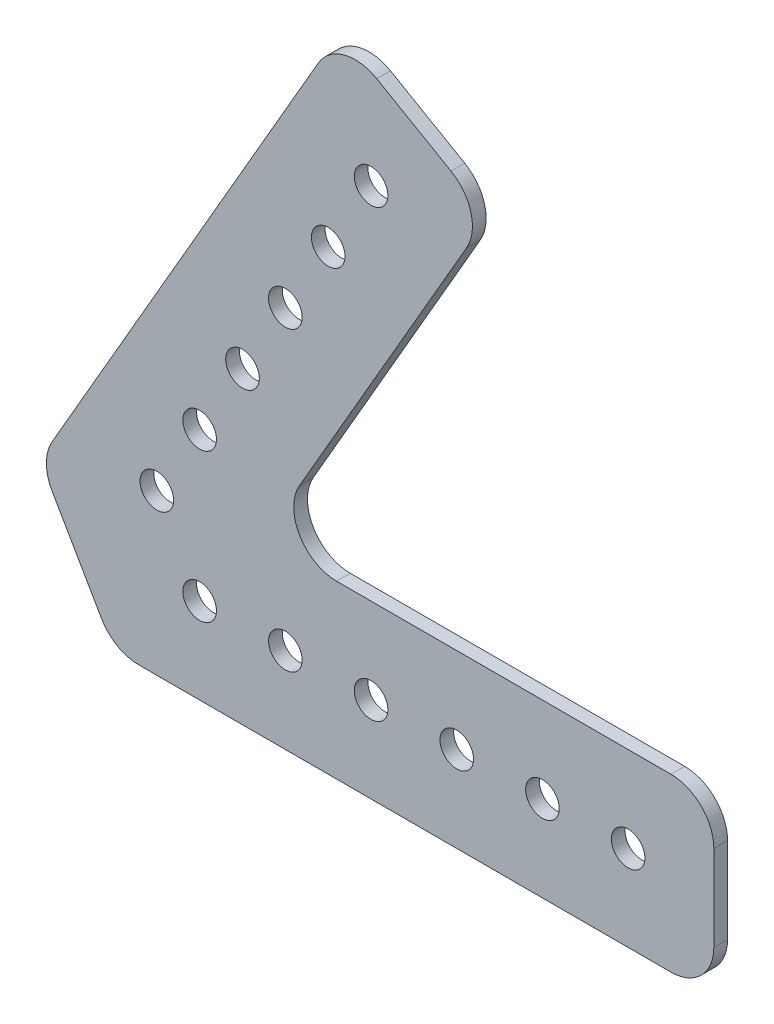
ISO-10303-21;
HEADER;
FILE_DESCRIPTION(('STEP AP214'),'2;1');
FILE_NAME('part.step','',(''),(''),'','','');
FILE_SCHEMA(('AUTOMOTIVE_DESIGN { 1 0 10303 214 1 1 1 1 }'));
ENDSEC;
DATA;
#1=APPLICATION_CONTEXT('core data for automotive mechanical design processes');
#2=APPLICATION_PROTOCOL_DEFINITION('international standard','automotive_design',2000,#1);
#3=PRODUCT_CONTEXT('',#1,'mechanical');
#4=PRODUCT('Part','Part','',(#3));
#5=PRODUCT_RELATED_PRODUCT_CATEGORY('part','',(#4));
#6=PRODUCT_DEFINITION_FORMATION('','',#4);
#7=PRODUCT_DEFINITION_CONTEXT('part definition',#1,'design');
#8=PRODUCT_DEFINITION('design','',#6,#7);
#9=PRODUCT_DEFINITION_SHAPE('','',#8);
#10=(LENGTH_UNIT() NAMED_UNIT(*) SI_UNIT(.MILLI.,.METRE.));
#11=(NAMED_UNIT(*) PLANE_ANGLE_UNIT() SI_UNIT($,.RADIAN.));
#12=(NAMED_UNIT(*) SI_UNIT($,.STERADIAN.) SOLID_ANGLE_UNIT());
#13=UNCERTAINTY_MEASURE_WITH_UNIT(LENGTH_MEASURE(1.E-05),#10,'distance_accuracy_value','');
#14=(GEOMETRIC_REPRESENTATION_CONTEXT(3) GLOBAL_UNCERTAINTY_ASSIGNED_CONTEXT((#13)) GLOBAL_UNIT_ASSIGNED_CONTEXT((#10,
#11,#12)) REPRESENTATION_CONTEXT('',''));
#15=CARTESIAN_POINT('',(0.,0.,0.));
#16=DIRECTION('',(0.,0.,1.));
#17=DIRECTION('',(1.,0.,0.));
#18=AXIS2_PLACEMENT_3D('',#15,#16,#17);
#19=CARTESIAN_POINT('',(-51.137282984279,34.5023148343583,0.));
#20=DIRECTION('',(0.,0.,1.));
#21=DIRECTION('',(1.,0.,0.));
#22=AXIS2_PLACEMENT_3D('',#19,#20,#21);
#23=PLANE('',#22);
#24=CARTESIAN_POINT('',(-12.7,12.7,0.));
#25=DIRECTION('',(0.,0.,1.));
#26=DIRECTION('',(1.,0.,0.));
#27=AXIS2_PLACEMENT_3D('',#24,#25,#26);
#28=CIRCLE('',#27,2.4892);
#29=CARTESIAN_POINT('',(-10.2108,12.7,0.));
#30=VERTEX_POINT('',#29);
#31=EDGE_CURVE('E222',#30,#30,#28,.T.);
#32=ORIENTED_EDGE('',*,*,#31,.T.);
#33=EDGE_LOOP('',(#32));
#34=FACE_BOUND('',#33,.T.);
#35=CARTESIAN_POINT('',(-57.15,67.6926131403119,0.));
#36=DIRECTION('',(0.,0.,1.));
#37=DIRECTION('',(1.,0.,0.));
#38=AXIS2_PLACEMENT_3D('',#35,#36,#37);
#39=CIRCLE('',#38,2.4892);
#40=CARTESIAN_POINT('',(-54.6608,67.6926131403119,0.));
#41=VERTEX_POINT('',#40);
#42=EDGE_CURVE('E225',#41,#41,#39,.T.);
#43=ORIENTED_EDGE('',*,*,#42,.T.);
#44=EDGE_LOOP('',(#43));
#45=FACE_BOUND('',#44,.T.);
#46=CARTESIAN_POINT('',(-69.85,45.6955678841872,0.));
#47=DIRECTION('',(0.,0.,1.));
#48=DIRECTION('',(1.,0.,0.));
#49=AXIS2_PLACEMENT_3D('',#46,#47,#48);
#50=CIRCLE('',#49,2.4892);
#51=CARTESIAN_POINT('',(-67.3608,45.6955678841872,0.));
#52=VERTEX_POINT('',#51);
#53=EDGE_CURVE('E228',#52,#52,#50,.T.);
#54=ORIENTED_EDGE('',*,*,#53,.T.);
#55=EDGE_LOOP('',(#54));
#56=FACE_BOUND('',#55,.T.);
#57=CARTESIAN_POINT('',(-25.4,12.7,0.));
#58=DIRECTION('',(0.,0.,1.));
#59=DIRECTION('',(1.,0.,0.));
#60=AXIS2_PLACEMENT_3D('',#57,#58,#59);
#61=CIRCLE('',#60,2.4892);
#62=CARTESIAN_POINT('',(-22.9108,12.7,0.));
#63=VERTEX_POINT('',#62);
#64=EDGE_CURVE('E231',#63,#63,#61,.T.);
#65=ORIENTED_EDGE('',*,*,#64,.T.);
#66=EDGE_LOOP('',(#65));
#67=FACE_BOUND('',#66,.T.);
#68=CARTESIAN_POINT('',(-50.8,12.7,0.));
#69=DIRECTION('',(0.,0.,1.));
#70=DIRECTION('',(1.,0.,0.));
#71=AXIS2_PLACEMENT_3D('',#68,#69,#70);
#72=CIRCLE('',#71,2.4892);
#73=CARTESIAN_POINT('',(-48.3108,12.7,0.));
#74=VERTEX_POINT('',#73);
#75=EDGE_CURVE('E234',#74,#74,#72,.T.);
#76=ORIENTED_EDGE('',*,*,#75,.T.);
#77=EDGE_LOOP('',(#76));
#78=FACE_BOUND('',#77,.T.);
#79=CARTESIAN_POINT('',(-82.55,23.6985226280624,0.));
#80=DIRECTION('',(0.,0.,1.));
#81=DIRECTION('',(1.,0.,0.));
#82=AXIS2_PLACEMENT_3D('',#79,#80,#81);
#83=CIRCLE('',#82,2.4892);
#84=CARTESIAN_POINT('',(-80.0608,23.6985226280624,0.));
#85=VERTEX_POINT('',#84);
#86=EDGE_CURVE('E237',#85,#85,#83,.T.);
#87=ORIENTED_EDGE('',*,*,#86,.T.);
#88=EDGE_LOOP('',(#87));
#89=FACE_BOUND('',#88,.T.);
#90=CARTESIAN_POINT('',(-76.2,12.7,0.));
#91=DIRECTION('',(0.,0.,1.));
#92=DIRECTION('',(1.,0.,0.));
#93=AXIS2_PLACEMENT_3D('',#90,#91,#92);
#94=CIRCLE('',#93,2.4892);
#95=CARTESIAN_POINT('',(-73.7108,12.7,0.));
#96=VERTEX_POINT('',#95);
#97=EDGE_CURVE('E240',#96,#96,#94,.T.);
#98=ORIENTED_EDGE('',*,*,#97,.T.);
#99=EDGE_LOOP('',(#98));
#100=FACE_BOUND('',#99,.T.);
#101=CARTESIAN_POINT('',(-63.5,12.7,0.));
#102=DIRECTION('',(0.,0.,1.));
#103=DIRECTION('',(1.,0.,0.));
#104=AXIS2_PLACEMENT_3D('',#101,#102,#103);
#105=CIRCLE('',#104,2.4892);
#106=CARTESIAN_POINT('',(-61.0108,12.7,0.));
#107=VERTEX_POINT('',#106);
#108=EDGE_CURVE('E243',#107,#107,#105,.T.);
#109=ORIENTED_EDGE('',*,*,#108,.T.);
#110=EDGE_LOOP('',(#109));
#111=FACE_BOUND('',#110,.T.);
#112=CARTESIAN_POINT('',(-38.1,12.7,0.));
#113=DIRECTION('',(0.,0.,1.));
#114=DIRECTION('',(1.,0.,0.));
#115=AXIS2_PLACEMENT_3D('',#112,#113,#114);
#116=CIRCLE('',#115,2.4892);
#117=CARTESIAN_POINT('',(-35.6108,12.7,0.));
#118=VERTEX_POINT('',#117);
#119=EDGE_CURVE('E246',#118,#118,#116,.T.);
#120=ORIENTED_EDGE('',*,*,#119,.T.);
#121=EDGE_LOOP('',(#120));
#122=FACE_BOUND('',#121,.T.);
#123=CARTESIAN_POINT('',(-76.2,34.6970452561248,0.));
#124=DIRECTION('',(0.,0.,1.));
#125=DIRECTION('',(1.,0.,0.));
#126=AXIS2_PLACEMENT_3D('',#123,#124,#125);
#127=CIRCLE('',#126,2.4892);
#128=CARTESIAN_POINT('',(-73.7108,34.6970452561248,0.));
#129=VERTEX_POINT('',#128);
#130=EDGE_CURVE('E249',#129,#129,#127,.T.);
#131=ORIENTED_EDGE('',*,*,#130,.T.);
#132=EDGE_LOOP('',(#131));
#133=FACE_BOUND('',#132,.T.);
#134=CARTESIAN_POINT('',(-63.5,56.6940905122495,0.));
#135=DIRECTION('',(0.,0.,1.));
#136=DIRECTION('',(1.,0.,0.));
#137=AXIS2_PLACEMENT_3D('',#134,#135,#136);
#138=CIRCLE('',#137,2.4892);
#139=CARTESIAN_POINT('',(-61.0108,56.6940905122495,0.));
#140=VERTEX_POINT('',#139);
#141=EDGE_CURVE('E136',#140,#140,#138,.T.);
#142=ORIENTED_EDGE('',*,*,#141,.T.);
#143=EDGE_LOOP('',(#142));
#144=FACE_BOUND('',#143,.T.);
#145=CARTESIAN_POINT('',(-50.8,78.6911357683743,0.));
#146=DIRECTION('',(0.,0.,1.));
#147=DIRECTION('',(1.,0.,0.));
#148=AXIS2_PLACEMENT_3D('',#145,#146,#147);
#149=CIRCLE('',#148,2.4892);
#150=CARTESIAN_POINT('',(-48.3108,78.6911357683743,0.));
#151=VERTEX_POINT('',#150);
#152=EDGE_CURVE('E133',#151,#151,#149,.T.);
#153=ORIENTED_EDGE('',*,*,#152,.T.);
#154=EDGE_LOOP('',(#153));
#155=FACE_BOUND('',#154,.T.);
#156=DIRECTION('',(-0.5,-0.866025403784439,0.));
#157=VECTOR('',#156,1.);
#158=CARTESIAN_POINT('',(-55.4485226280624,96.0396583964365,0.));
#159=LINE('',#158,#157);
#160=CARTESIAN_POINT('',(-58.6235226280623,90.5403970824054,0.));
#161=VERTEX_POINT('',#160);
#162=CARTESIAN_POINT('',(-98.0654355233853,22.2249999999999,0.));
#163=VERTEX_POINT('',#162);
#164=EDGE_CURVE('E117',#161,#163,#159,.T.);
#165=ORIENTED_EDGE('',*,*,#164,.F.);
#166=CARTESIAN_POINT('',(-53.1242613140312,87.3653970824055,0.));
#167=DIRECTION('',(0.,0.,1.));
#168=DIRECTION('',(1.,0.,0.));
#169=AXIS2_PLACEMENT_3D('',#166,#167,#168);
#170=CIRCLE('',#169,6.35);
#171=CARTESIAN_POINT('',(-49.9492613140311,92.8646583964367,0.));
#172=VERTEX_POINT('',#171);
#173=EDGE_CURVE('E130',#172,#161,#170,.T.);
#174=ORIENTED_EDGE('',*,*,#173,.F.);
#175=DIRECTION('',(-0.866025403784439,0.5,0.));
#176=VECTOR('',#175,1.);
#177=CARTESIAN_POINT('',(-33.4514773719376,83.3396583964367,0.));
#178=LINE('',#177,#176);
#179=CARTESIAN_POINT('',(-38.9507386859688,86.5146583964367,0.));
#180=VERTEX_POINT('',#179);
#181=EDGE_CURVE('E142',#180,#172,#178,.T.);
#182=ORIENTED_EDGE('',*,*,#181,.F.);
#183=CARTESIAN_POINT('',(-42.1257386859688,81.0153970824055,0.));
#184=DIRECTION('',(0.,0.,1.));
#185=DIRECTION('',(1.,0.,0.));
#186=AXIS2_PLACEMENT_3D('',#183,#184,#185);
#187=CIRCLE('',#186,6.35);
#188=CARTESIAN_POINT('',(-36.6264773719376,77.8403970824055,0.));
#189=VERTEX_POINT('',#188);
#190=EDGE_CURVE('E255',#189,#180,#187,.T.);
#191=ORIENTED_EDGE('',*,*,#190,.F.);
#192=DIRECTION('',(0.5,0.866025403784439,0.));
#193=VECTOR('',#192,1.);
#194=CARTESIAN_POINT('',(-66.9029547438752,25.4,0.));
#195=LINE('',#194,#193);
#196=CARTESIAN_POINT('',(-61.403693429844,34.925,0.));
#197=VERTEX_POINT('',#196);
#198=EDGE_CURVE('E146',#197,#189,#195,.T.);
#199=ORIENTED_EDGE('',*,*,#198,.F.);
#200=CARTESIAN_POINT('',(-55.9044321158128,31.75,0.));
#201=DIRECTION('',(0.,0.,1.));
#202=DIRECTION('',(1.,0.,0.));
#203=AXIS2_PLACEMENT_3D('',#200,#201,#202);
#204=CIRCLE('',#203,6.35);
#205=CARTESIAN_POINT('',(-55.9044321158128,25.4,0.));
#206=VERTEX_POINT('',#205);
#207=EDGE_CURVE('E257',#197,#206,#204,.T.);
#208=ORIENTED_EDGE('',*,*,#207,.T.);
#209=DIRECTION('',(1.,0.,0.));
#210=VECTOR('',#209,1.);
#211=CARTESIAN_POINT('',(0.,25.4,0.));
#212=LINE('',#211,#210);
#213=CARTESIAN_POINT('',(-6.35,25.4,0.));
#214=VERTEX_POINT('',#213);
#215=EDGE_CURVE('E150',#214,#206,#212,.F.);
#216=ORIENTED_EDGE('',*,*,#215,.F.);
#217=CARTESIAN_POINT('',(-6.35,19.05,0.));
#218=DIRECTION('',(0.,0.,1.));
#219=DIRECTION('',(1.,0.,0.));
#220=AXIS2_PLACEMENT_3D('',#217,#218,#219);
#221=CIRCLE('',#220,6.35);
#222=CARTESIAN_POINT('',(0.,19.05,0.));
#223=VERTEX_POINT('',#222);
#224=EDGE_CURVE('E260',#223,#214,#221,.T.);
#225=ORIENTED_EDGE('',*,*,#224,.F.);
#226=DIRECTION('',(0.,1.,0.));
#227=VECTOR('',#226,1.);
#228=CARTESIAN_POINT('',(0.,0.,0.));
#229=LINE('',#228,#227);
#230=CARTESIAN_POINT('',(0.,6.35,0.));
#231=VERTEX_POINT('',#230);
#232=EDGE_CURVE('E154',#231,#223,#229,.T.);
#233=ORIENTED_EDGE('',*,*,#232,.F.);
#234=CARTESIAN_POINT('',(-6.35,6.35,0.));
#235=DIRECTION('',(0.,0.,1.));
#236=DIRECTION('',(1.,0.,0.));
#237=AXIS2_PLACEMENT_3D('',#234,#235,#236);
#238=CIRCLE('',#237,6.35);
#239=CARTESIAN_POINT('',(-6.35,0.,0.));
#240=VERTEX_POINT('',#239);
#241=EDGE_CURVE('E262',#240,#231,#238,.T.);
#242=ORIENTED_EDGE('',*,*,#241,.F.);
#243=DIRECTION('',(1.,0.,0.));
#244=VECTOR('',#243,1.);
#245=CARTESIAN_POINT('',(-88.9,0.,0.));
#246=LINE('',#245,#244);
#247=CARTESIAN_POINT('',(-85.2338257906458,0.,0.));
#248=VERTEX_POINT('',#247);
#249=EDGE_CURVE('E158',#248,#240,#246,.T.);
#250=ORIENTED_EDGE('',*,*,#249,.F.);
#251=CARTESIAN_POINT('',(-85.2338257906458,6.35,0.));
#252=DIRECTION('',(0.,0.,1.));
#253=DIRECTION('',(1.,0.,0.));
#254=AXIS2_PLACEMENT_3D('',#251,#252,#253);
#255=CIRCLE('',#254,6.35);
#256=CARTESIAN_POINT('',(-90.733087104677,3.17499999999999,0.));
#257=VERTEX_POINT('',#256);
#258=EDGE_CURVE('E263',#257,#248,#255,.T.);
#259=ORIENTED_EDGE('',*,*,#258,.F.);
#260=DIRECTION('',(0.499999999999999,-0.866025403784439,0.));
#261=VECTOR('',#260,1.);
#262=CARTESIAN_POINT('',(-99.8985226280624,19.05,0.));
#263=LINE('',#262,#261);
#264=CARTESIAN_POINT('',(-98.0654355233853,15.875,0.));
#265=VERTEX_POINT('',#264);
#266=EDGE_CURVE('E119',#265,#257,#263,.T.);
#267=ORIENTED_EDGE('',*,*,#266,.F.);
#268=CARTESIAN_POINT('',(-92.5661742093542,19.05,0.));
#269=DIRECTION('',(0.,0.,1.));
#270=DIRECTION('',(1.,0.,0.));
#271=AXIS2_PLACEMENT_3D('',#268,#269,#270);
#272=CIRCLE('',#271,6.35);
#273=EDGE_CURVE('E18',#163,#265,#272,.T.);
#274=ORIENTED_EDGE('',*,*,#273,.F.);
#275=EDGE_LOOP('',(#165,#174,#182,#191,#199,#208,#216,#225,#233,#242,#250,#259,#267,#274));
#276=FACE_BOUND('',#275,.T.);
#277=ADVANCED_FACE('F15',(#34,#45,#56,#67,#78,#89,#100,#111,#122,#133,#144,#155,#276),#23,.F.);
#278=CARTESIAN_POINT('',(-92.5661742093542,19.05,0.));
#279=DIRECTION('',(0.,0.,1.));
#280=DIRECTION('',(1.,0.,0.));
#281=AXIS2_PLACEMENT_3D('',#278,#279,#280);
#282=CYLINDRICAL_SURFACE('',#281,6.35);
#283=ORIENTED_EDGE('',*,*,#273,.T.);
#284=DIRECTION('',(0.,0.,1.));
#285=VECTOR('',#284,1.);
#286=CARTESIAN_POINT('',(-98.0654355233853,15.875,0.));
#287=LINE('',#286,#285);
#288=CARTESIAN_POINT('',(-98.0654355233853,15.875,2.032));
#289=VERTEX_POINT('',#288);
#290=EDGE_CURVE('E122',#289,#265,#287,.F.);
#291=ORIENTED_EDGE('',*,*,#290,.F.);
#292=CARTESIAN_POINT('',(-92.5661742093542,19.05,2.032));
#293=DIRECTION('',(0.,0.,1.));
#294=DIRECTION('',(1.,0.,0.));
#295=AXIS2_PLACEMENT_3D('',#292,#293,#294);
#296=CIRCLE('',#295,6.35);
#297=CARTESIAN_POINT('',(-98.0654355233853,22.225,2.032));
#298=VERTEX_POINT('',#297);
#299=EDGE_CURVE('E127',#298,#289,#296,.T.);
#300=ORIENTED_EDGE('',*,*,#299,.F.);
#301=DIRECTION('',(0.,0.,1.));
#302=VECTOR('',#301,1.);
#303=CARTESIAN_POINT('',(-98.0654355233853,22.2249999999999,0.));
#304=LINE('',#303,#302);
#305=EDGE_CURVE('E124',#163,#298,#304,.T.);
#306=ORIENTED_EDGE('',*,*,#305,.F.);
#307=EDGE_LOOP('',(#283,#291,#300,#306));
#308=FACE_BOUND('',#307,.T.);
#309=ADVANCED_FACE('F125',(#308),#282,.T.);
#310=CARTESIAN_POINT('',(-99.8985226280624,19.05,0.));
#311=DIRECTION('',(-0.866025403784439,-0.499999999999999,0.));
#312=DIRECTION('',(0.499999999999999,-0.866025403784439,0.));
#313=AXIS2_PLACEMENT_3D('',#310,#311,#312);
#314=PLANE('',#313);
#315=DIRECTION('',(0.,0.,1.));
#316=VECTOR('',#315,1.);
#317=CARTESIAN_POINT('',(-90.733087104677,3.17500000000002,0.));
#318=LINE('',#317,#316);
#319=CARTESIAN_POINT('',(-90.733087104677,3.17499999999998,2.032));
#320=VERTEX_POINT('',#319);
#321=EDGE_CURVE('E162',#320,#257,#318,.F.);
#322=ORIENTED_EDGE('',*,*,#321,.F.);
#323=DIRECTION('',(0.500000000000009,-0.866025403784433,0.));
#324=VECTOR('',#323,1.);
#325=CARTESIAN_POINT('',(-98.0654355233854,15.875,2.032));
#326=LINE('',#325,#324);
#327=EDGE_CURVE('E220',#289,#320,#326,.T.);
#328=ORIENTED_EDGE('',*,*,#327,.F.);
#329=ORIENTED_EDGE('',*,*,#290,.T.);
#330=ORIENTED_EDGE('',*,*,#266,.T.);
#331=EDGE_LOOP('',(#322,#328,#329,#330));
#332=FACE_BOUND('',#331,.T.);
#333=ADVANCED_FACE('F341',(#332),#314,.T.);
#334=CARTESIAN_POINT('',(-85.2338257906458,6.35,0.));
#335=DIRECTION('',(0.,0.,1.));
#336=DIRECTION('',(1.,0.,0.));
#337=AXIS2_PLACEMENT_3D('',#334,#335,#336);
#338=CYLINDRICAL_SURFACE('',#337,6.35);
#339=ORIENTED_EDGE('',*,*,#258,.T.);
#340=DIRECTION('',(0.,0.,-1.));
#341=VECTOR('',#340,1.);
#342=CARTESIAN_POINT('',(-85.2338257906458,0.,0.));
#343=LINE('',#342,#341);
#344=CARTESIAN_POINT('',(-85.2338257906458,0.,2.032));
#345=VERTEX_POINT('',#344);
#346=EDGE_CURVE('E161',#345,#248,#343,.T.);
#347=ORIENTED_EDGE('',*,*,#346,.F.);
#348=CARTESIAN_POINT('',(-85.2338257906458,6.35,2.032));
#349=DIRECTION('',(0.,0.,1.));
#350=DIRECTION('',(1.,0.,0.));
#351=AXIS2_PLACEMENT_3D('',#348,#349,#350);
#352=CIRCLE('',#351,6.35);
#353=EDGE_CURVE('E217',#320,#345,#352,.T.);
#354=ORIENTED_EDGE('',*,*,#353,.F.);
#355=ORIENTED_EDGE('',*,*,#321,.T.);
#356=EDGE_LOOP('',(#339,#347,#354,#355));
#357=FACE_BOUND('',#356,.T.);
#358=ADVANCED_FACE('F338',(#357),#338,.T.);
#359=CARTESIAN_POINT('',(-88.9,0.,0.));
#360=DIRECTION('',(0.,-1.,0.));
#361=DIRECTION('',(0.,0.,-1.));
#362=AXIS2_PLACEMENT_3D('',#359,#360,#361);
#363=PLANE('',#362);
#364=DIRECTION('',(0.,0.,1.));
#365=VECTOR('',#364,1.);
#366=CARTESIAN_POINT('',(-6.35,0.,0.));
#367=LINE('',#366,#365);
#368=CARTESIAN_POINT('',(-6.35,0.,2.032));
#369=VERTEX_POINT('',#368);
#370=EDGE_CURVE('E160',#369,#240,#367,.F.);
#371=ORIENTED_EDGE('',*,*,#370,.F.);
#372=DIRECTION('',(1.,0.,0.));
#373=VECTOR('',#372,1.);
#374=CARTESIAN_POINT('',(-51.137282984279,0.,2.032));
#375=LINE('',#374,#373);
#376=EDGE_CURVE('E216',#345,#369,#375,.T.);
#377=ORIENTED_EDGE('',*,*,#376,.F.);
#378=ORIENTED_EDGE('',*,*,#346,.T.);
#379=ORIENTED_EDGE('',*,*,#249,.T.);
#380=EDGE_LOOP('',(#371,#377,#378,#379));
#381=FACE_BOUND('',#380,.T.);
#382=ADVANCED_FACE('F337',(#381),#363,.T.);
#383=CARTESIAN_POINT('',(-6.35,6.35,0.));
#384=DIRECTION('',(0.,0.,1.));
#385=DIRECTION('',(1.,0.,0.));
#386=AXIS2_PLACEMENT_3D('',#383,#384,#385);
#387=CYLINDRICAL_SURFACE('',#386,6.35);
#388=ORIENTED_EDGE('',*,*,#241,.T.);
#389=DIRECTION('',(0.,0.,1.));
#390=VECTOR('',#389,1.);
#391=CARTESIAN_POINT('',(0.,6.35,0.));
#392=LINE('',#391,#390);
#393=CARTESIAN_POINT('',(0.,6.35,2.032));
#394=VERTEX_POINT('',#393);
#395=EDGE_CURVE('E157',#394,#231,#392,.F.);
#396=ORIENTED_EDGE('',*,*,#395,.F.);
#397=CARTESIAN_POINT('',(-6.35,6.35,2.032));
#398=DIRECTION('',(0.,0.,1.));
#399=DIRECTION('',(1.,0.,0.));
#400=AXIS2_PLACEMENT_3D('',#397,#398,#399);
#401=CIRCLE('',#400,6.35);
#402=EDGE_CURVE('E213',#369,#394,#401,.T.);
#403=ORIENTED_EDGE('',*,*,#402,.F.);
#404=ORIENTED_EDGE('',*,*,#370,.T.);
#405=EDGE_LOOP('',(#388,#396,#403,#404));
#406=FACE_BOUND('',#405,.T.);
#407=ADVANCED_FACE('F334',(#406),#387,.T.);
#408=CARTESIAN_POINT('',(0.,0.,0.));
#409=DIRECTION('',(1.,0.,0.));
#410=DIRECTION('',(0.,1.,0.));
#411=AXIS2_PLACEMENT_3D('',#408,#409,#410);
#412=PLANE('',#411);
#413=DIRECTION('',(0.,0.,1.));
#414=VECTOR('',#413,1.);
#415=CARTESIAN_POINT('',(0.,19.05,0.));
#416=LINE('',#415,#414);
#417=CARTESIAN_POINT('',(0.,19.05,2.032));
#418=VERTEX_POINT('',#417);
#419=EDGE_CURVE('E156',#418,#223,#416,.F.);
#420=ORIENTED_EDGE('',*,*,#419,.F.);
#421=DIRECTION('',(0.,1.,0.));
#422=VECTOR('',#421,1.);
#423=CARTESIAN_POINT('',(0.,34.5023148343583,2.032));
#424=LINE('',#423,#422);
#425=EDGE_CURVE('E212',#394,#418,#424,.T.);
#426=ORIENTED_EDGE('',*,*,#425,.F.);
#427=ORIENTED_EDGE('',*,*,#395,.T.);
#428=ORIENTED_EDGE('',*,*,#232,.T.);
#429=EDGE_LOOP('',(#420,#426,#427,#428));
#430=FACE_BOUND('',#429,.T.);
#431=ADVANCED_FACE('F330',(#430),#412,.T.);
#432=CARTESIAN_POINT('',(-6.35,19.05,0.));
#433=DIRECTION('',(0.,0.,1.));
#434=DIRECTION('',(1.,0.,0.));
#435=AXIS2_PLACEMENT_3D('',#432,#433,#434);
#436=CYLINDRICAL_SURFACE('',#435,6.35);
#437=ORIENTED_EDGE('',*,*,#224,.T.);
#438=DIRECTION('',(0.,0.,1.));
#439=VECTOR('',#438,1.);
#440=CARTESIAN_POINT('',(-6.35,25.4,0.));
#441=LINE('',#440,#439);
#442=CARTESIAN_POINT('',(-6.35,25.4,2.032));
#443=VERTEX_POINT('',#442);
#444=EDGE_CURVE('E153',#443,#214,#441,.F.);
#445=ORIENTED_EDGE('',*,*,#444,.F.);
#446=CARTESIAN_POINT('',(-6.35,19.05,2.032));
#447=DIRECTION('',(0.,0.,1.));
#448=DIRECTION('',(1.,0.,0.));
#449=AXIS2_PLACEMENT_3D('',#446,#447,#448);
#450=CIRCLE('',#449,6.35);
#451=EDGE_CURVE('E209',#418,#443,#450,.T.);
#452=ORIENTED_EDGE('',*,*,#451,.F.);
#453=ORIENTED_EDGE('',*,*,#419,.T.);
#454=EDGE_LOOP('',(#437,#445,#452,#453));
#455=FACE_BOUND('',#454,.T.);
#456=ADVANCED_FACE('F327',(#455),#436,.T.);
#457=CARTESIAN_POINT('',(0.,25.4,0.));
#458=DIRECTION('',(0.,1.,0.));
#459=DIRECTION('',(0.,0.,1.));
#460=AXIS2_PLACEMENT_3D('',#457,#458,#459);
#461=PLANE('',#460);
#462=ORIENTED_EDGE('',*,*,#444,.T.);
#463=ORIENTED_EDGE('',*,*,#215,.T.);
#464=DIRECTION('',(0.,0.,1.));
#465=VECTOR('',#464,1.);
#466=CARTESIAN_POINT('',(-55.9044321158128,25.4,0.));
#467=LINE('',#466,#465);
#468=CARTESIAN_POINT('',(-55.9044321158128,25.4,2.032));
#469=VERTEX_POINT('',#468);
#470=EDGE_CURVE('E152',#206,#469,#467,.T.);
#471=ORIENTED_EDGE('',*,*,#470,.T.);
#472=DIRECTION('',(1.,0.,0.));
#473=VECTOR('',#472,1.);
#474=CARTESIAN_POINT('',(-51.137282984279,25.4,2.032));
#475=LINE('',#474,#473);
#476=EDGE_CURVE('E208',#443,#469,#475,.F.);
#477=ORIENTED_EDGE('',*,*,#476,.F.);
#478=EDGE_LOOP('',(#462,#463,#471,#477));
#479=FACE_BOUND('',#478,.T.);
#480=ADVANCED_FACE('F324',(#479),#461,.T.);
#481=CARTESIAN_POINT('',(-55.9044321158128,31.75,0.));
#482=DIRECTION('',(0.,0.,1.));
#483=DIRECTION('',(1.,0.,0.));
#484=AXIS2_PLACEMENT_3D('',#481,#482,#483);
#485=CYLINDRICAL_SURFACE('',#484,6.35);
#486=DIRECTION('',(0.,0.,1.));
#487=VECTOR('',#486,1.);
#488=CARTESIAN_POINT('',(-61.403693429844,34.925,0.));
#489=LINE('',#488,#487);
#490=CARTESIAN_POINT('',(-61.403693429844,34.925,2.032));
#491=VERTEX_POINT('',#490);
#492=EDGE_CURVE('E149',#491,#197,#489,.F.);
#493=ORIENTED_EDGE('',*,*,#492,.F.);
#494=CARTESIAN_POINT('',(-55.9044321158128,31.75,2.032));
#495=DIRECTION('',(0.,0.,1.));
#496=DIRECTION('',(1.,0.,0.));
#497=AXIS2_PLACEMENT_3D('',#494,#495,#496);
#498=CIRCLE('',#497,6.35);
#499=EDGE_CURVE('E205',#469,#491,#498,.F.);
#500=ORIENTED_EDGE('',*,*,#499,.F.);
#501=ORIENTED_EDGE('',*,*,#470,.F.);
#502=ORIENTED_EDGE('',*,*,#207,.F.);
#503=EDGE_LOOP('',(#493,#500,#501,#502));
#504=FACE_BOUND('',#503,.T.);
#505=ADVANCED_FACE('F317',(#504),#485,.F.);
#506=CARTESIAN_POINT('',(-66.9029547438752,25.4,0.));
#507=DIRECTION('',(0.866025403784439,-0.5,0.));
#508=DIRECTION('',(0.5,0.866025403784439,0.));
#509=AXIS2_PLACEMENT_3D('',#506,#507,#508);
#510=PLANE('',#509);
#511=DIRECTION('',(0.,0.,1.));
#512=VECTOR('',#511,1.);
#513=CARTESIAN_POINT('',(-36.6264773719376,77.8403970824055,0.));
#514=LINE('',#513,#512);
#515=CARTESIAN_POINT('',(-36.6264773719376,77.8403970824055,2.032));
#516=VERTEX_POINT('',#515);
#517=EDGE_CURVE('E148',#516,#189,#514,.F.);
#518=ORIENTED_EDGE('',*,*,#517,.F.);
#519=DIRECTION('',(0.499999999999999,0.866025403784439,0.));
#520=VECTOR('',#519,1.);
#521=CARTESIAN_POINT('',(-61.403693429844,34.925,2.032));
#522=LINE('',#521,#520);
#523=EDGE_CURVE('E204',#491,#516,#522,.T.);
#524=ORIENTED_EDGE('',*,*,#523,.F.);
#525=ORIENTED_EDGE('',*,*,#492,.T.);
#526=ORIENTED_EDGE('',*,*,#198,.T.);
#527=EDGE_LOOP('',(#518,#524,#525,#526));
#528=FACE_BOUND('',#527,.T.);
#529=ADVANCED_FACE('F314',(#528),#510,.T.);
#530=CARTESIAN_POINT('',(-42.1257386859688,81.0153970824055,0.));
#531=DIRECTION('',(0.,0.,1.));
#532=DIRECTION('',(1.,0.,0.));
#533=AXIS2_PLACEMENT_3D('',#530,#531,#532);
#534=CYLINDRICAL_SURFACE('',#533,6.35);
#535=ORIENTED_EDGE('',*,*,#190,.T.);
#536=DIRECTION('',(0.,0.,1.));
#537=VECTOR('',#536,1.);
#538=CARTESIAN_POINT('',(-38.9507386859688,86.5146583964367,0.));
#539=LINE('',#538,#537);
#540=CARTESIAN_POINT('',(-38.9507386859689,86.5146583964367,2.032));
#541=VERTEX_POINT('',#540);
#542=EDGE_CURVE('E145',#541,#180,#539,.F.);
#543=ORIENTED_EDGE('',*,*,#542,.F.);
#544=CARTESIAN_POINT('',(-42.1257386859688,81.0153970824055,2.032));
#545=DIRECTION('',(0.,0.,1.));
#546=DIRECTION('',(1.,0.,0.));
#547=AXIS2_PLACEMENT_3D('',#544,#545,#546);
#548=CIRCLE('',#547,6.35);
#549=EDGE_CURVE('E201',#516,#541,#548,.T.);
#550=ORIENTED_EDGE('',*,*,#549,.F.);
#551=ORIENTED_EDGE('',*,*,#517,.T.);
#552=EDGE_LOOP('',(#535,#543,#550,#551));
#553=FACE_BOUND('',#552,.T.);
#554=ADVANCED_FACE('F311',(#553),#534,.T.);
#555=CARTESIAN_POINT('',(-33.4514773719376,83.3396583964367,0.));
#556=DIRECTION('',(0.5,0.866025403784439,0.));
#557=DIRECTION('',(-0.866025403784439,0.5,0.));
#558=AXIS2_PLACEMENT_3D('',#555,#556,#557);
#559=PLANE('',#558);
#560=DIRECTION('',(0.,0.,1.));
#561=VECTOR('',#560,1.);
#562=CARTESIAN_POINT('',(-49.9492613140311,92.8646583964366,0.));
#563=LINE('',#562,#561);
#564=CARTESIAN_POINT('',(-49.9492613140312,92.8646583964366,2.032));
#565=VERTEX_POINT('',#564);
#566=EDGE_CURVE('E144',#565,#172,#563,.F.);
#567=ORIENTED_EDGE('',*,*,#566,.F.);
#568=DIRECTION('',(-0.866025403784448,0.499999999999984,0.));
#569=VECTOR('',#568,1.);
#570=CARTESIAN_POINT('',(-38.9507386859688,86.5146583964367,2.032));
#571=LINE('',#570,#569);
#572=EDGE_CURVE('E200',#541,#565,#571,.T.);
#573=ORIENTED_EDGE('',*,*,#572,.F.);
#574=ORIENTED_EDGE('',*,*,#542,.T.);
#575=ORIENTED_EDGE('',*,*,#181,.T.);
#576=EDGE_LOOP('',(#567,#573,#574,#575));
#577=FACE_BOUND('',#576,.T.);
#578=ADVANCED_FACE('F305',(#577),#559,.T.);
#579=CARTESIAN_POINT('',(-53.1242613140312,87.3653970824055,0.));
#580=DIRECTION('',(0.,0.,1.));
#581=DIRECTION('',(1.,0.,0.));
#582=AXIS2_PLACEMENT_3D('',#579,#580,#581);
#583=CYLINDRICAL_SURFACE('',#582,6.35);
#584=ORIENTED_EDGE('',*,*,#173,.T.);
#585=DIRECTION('',(0.,0.,1.));
#586=VECTOR('',#585,1.);
#587=CARTESIAN_POINT('',(-58.6235226280623,90.5403970824054,0.));
#588=LINE('',#587,#586);
#589=CARTESIAN_POINT('',(-58.6235226280623,90.5403970824055,2.032));
#590=VERTEX_POINT('',#589);
#591=EDGE_CURVE('E33',#590,#161,#588,.F.);
#592=ORIENTED_EDGE('',*,*,#591,.F.);
#593=CARTESIAN_POINT('',(-53.1242613140312,87.3653970824055,2.032));
#594=DIRECTION('',(0.,0.,1.));
#595=DIRECTION('',(1.,0.,0.));
#596=AXIS2_PLACEMENT_3D('',#593,#594,#595);
#597=CIRCLE('',#596,6.35);
#598=EDGE_CURVE('E197',#565,#590,#597,.T.);
#599=ORIENTED_EDGE('',*,*,#598,.F.);
#600=ORIENTED_EDGE('',*,*,#566,.T.);
#601=EDGE_LOOP('',(#584,#592,#599,#600));
#602=FACE_BOUND('',#601,.T.);
#603=ADVANCED_FACE('F303',(#602),#583,.T.);
#604=CARTESIAN_POINT('',(-55.4485226280624,96.0396583964365,0.));
#605=DIRECTION('',(-0.866025403784439,0.5,0.));
#606=DIRECTION('',(-0.5,-0.866025403784439,0.));
#607=AXIS2_PLACEMENT_3D('',#604,#605,#606);
#608=PLANE('',#607);
#609=ORIENTED_EDGE('',*,*,#591,.T.);
#610=ORIENTED_EDGE('',*,*,#164,.T.);
#611=ORIENTED_EDGE('',*,*,#305,.T.);
#612=DIRECTION('',(-0.5,-0.866025403784439,0.));
#613=VECTOR('',#612,1.);
#614=CARTESIAN_POINT('',(-58.6235226280624,90.5403970824055,2.032));
#615=LINE('',#614,#613);
#616=EDGE_CURVE('E196',#590,#298,#615,.T.);
#617=ORIENTED_EDGE('',*,*,#616,.F.);
#618=EDGE_LOOP('',(#609,#610,#611,#617));
#619=FACE_BOUND('',#618,.T.);
#620=ADVANCED_FACE('F132',(#619),#608,.T.);
#621=CARTESIAN_POINT('',(-50.8,78.6911357683743,138.590980342062));
#622=DIRECTION('',(0.,0.,1.));
#623=DIRECTION('',(1.,0.,0.));
#624=AXIS2_PLACEMENT_3D('',#621,#622,#623);
#625=CYLINDRICAL_SURFACE('',#624,2.4892);
#626=ORIENTED_EDGE('',*,*,#152,.F.);
#627=EDGE_LOOP('',(#626));
#628=FACE_BOUND('',#627,.T.);
#629=CARTESIAN_POINT('',(-50.8,78.6911357683743,2.03200000000001));
#630=DIRECTION('',(0.,0.,1.));
#631=DIRECTION('',(1.,0.,0.));
#632=AXIS2_PLACEMENT_3D('',#629,#630,#631);
#633=CIRCLE('',#632,2.4892);
#634=CARTESIAN_POINT('',(-48.3108,78.6911357683743,2.03200000000001));
#635=VERTEX_POINT('',#634);
#636=EDGE_CURVE('E193',#635,#635,#633,.F.);
#637=ORIENTED_EDGE('',*,*,#636,.F.);
#638=EDGE_LOOP('',(#637));
#639=FACE_BOUND('',#638,.T.);
#640=ADVANCED_FACE('F400',(#628,#639),#625,.F.);
#641=CARTESIAN_POINT('',(-63.5,56.6940905122495,138.590980342062));
#642=DIRECTION('',(0.,0.,1.));
#643=DIRECTION('',(1.,0.,0.));
#644=AXIS2_PLACEMENT_3D('',#641,#642,#643);
#645=CYLINDRICAL_SURFACE('',#644,2.4892);
#646=ORIENTED_EDGE('',*,*,#141,.F.);
#647=EDGE_LOOP('',(#646));
#648=FACE_BOUND('',#647,.T.);
#649=CARTESIAN_POINT('',(-63.5,56.6940905122495,2.03200000000001));
#650=DIRECTION('',(0.,0.,1.));
#651=DIRECTION('',(1.,0.,0.));
#652=AXIS2_PLACEMENT_3D('',#649,#650,#651);
#653=CIRCLE('',#652,2.4892);
#654=CARTESIAN_POINT('',(-61.0108,56.6940905122495,2.03200000000001));
#655=VERTEX_POINT('',#654);
#656=EDGE_CURVE('E190',#655,#655,#653,.F.);
#657=ORIENTED_EDGE('',*,*,#656,.F.);
#658=EDGE_LOOP('',(#657));
#659=FACE_BOUND('',#658,.T.);
#660=ADVANCED_FACE('F396',(#648,#659),#645,.F.);
#661=CARTESIAN_POINT('',(-76.2,34.6970452561248,138.590980342062));
#662=DIRECTION('',(0.,0.,1.));
#663=DIRECTION('',(1.,0.,0.));
#664=AXIS2_PLACEMENT_3D('',#661,#662,#663);
#665=CYLINDRICAL_SURFACE('',#664,2.4892);
#666=ORIENTED_EDGE('',*,*,#130,.F.);
#667=EDGE_LOOP('',(#666));
#668=FACE_BOUND('',#667,.T.);
#669=CARTESIAN_POINT('',(-76.2,34.6970452561248,2.03200000000001));
#670=DIRECTION('',(0.,0.,1.));
#671=DIRECTION('',(1.,0.,0.));
#672=AXIS2_PLACEMENT_3D('',#669,#670,#671);
#673=CIRCLE('',#672,2.4892);
#674=CARTESIAN_POINT('',(-73.7108,34.6970452561248,2.03200000000001));
#675=VERTEX_POINT('',#674);
#676=EDGE_CURVE('E187',#675,#675,#673,.F.);
#677=ORIENTED_EDGE('',*,*,#676,.F.);
#678=EDGE_LOOP('',(#677));
#679=FACE_BOUND('',#678,.T.);
#680=ADVANCED_FACE('F392',(#668,#679),#665,.F.);
#681=CARTESIAN_POINT('',(-38.1,12.7,138.590980342062));
#682=DIRECTION('',(0.,0.,1.));
#683=DIRECTION('',(1.,0.,0.));
#684=AXIS2_PLACEMENT_3D('',#681,#682,#683);
#685=CYLINDRICAL_SURFACE('',#684,2.4892);
#686=ORIENTED_EDGE('',*,*,#119,.F.);
#687=EDGE_LOOP('',(#686));
#688=FACE_BOUND('',#687,.T.);
#689=CARTESIAN_POINT('',(-38.1,12.7,2.03200000000001));
#690=DIRECTION('',(0.,0.,1.));
#691=DIRECTION('',(1.,0.,0.));
#692=AXIS2_PLACEMENT_3D('',#689,#690,#691);
#693=CIRCLE('',#692,2.4892);
#694=CARTESIAN_POINT('',(-35.6108,12.7,2.03200000000001));
#695=VERTEX_POINT('',#694);
#696=EDGE_CURVE('E184',#695,#695,#693,.F.);
#697=ORIENTED_EDGE('',*,*,#696,.F.);
#698=EDGE_LOOP('',(#697));
#699=FACE_BOUND('',#698,.T.);
#700=ADVANCED_FACE('F388',(#688,#699),#685,.F.);
#701=CARTESIAN_POINT('',(-63.5,12.7,138.590980342062));
#702=DIRECTION('',(0.,0.,1.));
#703=DIRECTION('',(1.,0.,0.));
#704=AXIS2_PLACEMENT_3D('',#701,#702,#703);
#705=CYLINDRICAL_SURFACE('',#704,2.4892);
#706=ORIENTED_EDGE('',*,*,#108,.F.);
#707=EDGE_LOOP('',(#706));
#708=FACE_BOUND('',#707,.T.);
#709=CARTESIAN_POINT('',(-63.5,12.7,2.03200000000001));
#710=DIRECTION('',(0.,0.,1.));
#711=DIRECTION('',(1.,0.,0.));
#712=AXIS2_PLACEMENT_3D('',#709,#710,#711);
#713=CIRCLE('',#712,2.4892);
#714=CARTESIAN_POINT('',(-61.0108,12.7,2.03200000000001));
#715=VERTEX_POINT('',#714);
#716=EDGE_CURVE('E181',#715,#715,#713,.F.);
#717=ORIENTED_EDGE('',*,*,#716,.F.);
#718=EDGE_LOOP('',(#717));
#719=FACE_BOUND('',#718,.T.);
#720=ADVANCED_FACE('F384',(#708,#719),#705,.F.);
#721=CARTESIAN_POINT('',(-76.2,12.7,138.590980342062));
#722=DIRECTION('',(0.,0.,1.));
#723=DIRECTION('',(1.,0.,0.));
#724=AXIS2_PLACEMENT_3D('',#721,#722,#723);
#725=CYLINDRICAL_SURFACE('',#724,2.4892);
#726=ORIENTED_EDGE('',*,*,#97,.F.);
#727=EDGE_LOOP('',(#726));
#728=FACE_BOUND('',#727,.T.);
#729=CARTESIAN_POINT('',(-76.2,12.7,2.03200000000001));
#730=DIRECTION('',(0.,0.,1.));
#731=DIRECTION('',(1.,0.,0.));
#732=AXIS2_PLACEMENT_3D('',#729,#730,#731);
#733=CIRCLE('',#732,2.4892);
#734=CARTESIAN_POINT('',(-73.7108,12.7,2.03200000000001));
#735=VERTEX_POINT('',#734);
#736=EDGE_CURVE('E178',#735,#735,#733,.F.);
#737=ORIENTED_EDGE('',*,*,#736,.F.);
#738=EDGE_LOOP('',(#737));
#739=FACE_BOUND('',#738,.T.);
#740=ADVANCED_FACE('F380',(#728,#739),#725,.F.);
#741=CARTESIAN_POINT('',(-82.55,23.6985226280624,138.590980342062));
#742=DIRECTION('',(0.,0.,1.));
#743=DIRECTION('',(1.,0.,0.));
#744=AXIS2_PLACEMENT_3D('',#741,#742,#743);
#745=CYLINDRICAL_SURFACE('',#744,2.4892);
#746=ORIENTED_EDGE('',*,*,#86,.F.);
#747=EDGE_LOOP('',(#746));
#748=FACE_BOUND('',#747,.T.);
#749=CARTESIAN_POINT('',(-82.55,23.6985226280624,2.03200000000001));
#750=DIRECTION('',(0.,0.,1.));
#751=DIRECTION('',(1.,0.,0.));
#752=AXIS2_PLACEMENT_3D('',#749,#750,#751);
#753=CIRCLE('',#752,2.4892);
#754=CARTESIAN_POINT('',(-80.0608,23.6985226280624,2.03200000000001));
#755=VERTEX_POINT('',#754);
#756=EDGE_CURVE('E175',#755,#755,#753,.F.);
#757=ORIENTED_EDGE('',*,*,#756,.F.);
#758=EDGE_LOOP('',(#757));
#759=FACE_BOUND('',#758,.T.);
#760=ADVANCED_FACE('F376',(#748,#759),#745,.F.);
#761=CARTESIAN_POINT('',(-50.8,12.7,138.590980342062));
#762=DIRECTION('',(0.,0.,1.));
#763=DIRECTION('',(1.,0.,0.));
#764=AXIS2_PLACEMENT_3D('',#761,#762,#763);
#765=CYLINDRICAL_SURFACE('',#764,2.4892);
#766=ORIENTED_EDGE('',*,*,#75,.F.);
#767=EDGE_LOOP('',(#766));
#768=FACE_BOUND('',#767,.T.);
#769=CARTESIAN_POINT('',(-50.8,12.7,2.03200000000001));
#770=DIRECTION('',(0.,0.,1.));
#771=DIRECTION('',(1.,0.,0.));
#772=AXIS2_PLACEMENT_3D('',#769,#770,#771);
#773=CIRCLE('',#772,2.4892);
#774=CARTESIAN_POINT('',(-48.3108,12.7,2.03200000000001));
#775=VERTEX_POINT('',#774);
#776=EDGE_CURVE('E172',#775,#775,#773,.F.);
#777=ORIENTED_EDGE('',*,*,#776,.F.);
#778=EDGE_LOOP('',(#777));
#779=FACE_BOUND('',#778,.T.);
#780=ADVANCED_FACE('F372',(#768,#779),#765,.F.);
#781=CARTESIAN_POINT('',(-25.4,12.7,138.590980342062));
#782=DIRECTION('',(0.,0.,1.));
#783=DIRECTION('',(1.,0.,0.));
#784=AXIS2_PLACEMENT_3D('',#781,#782,#783);
#785=CYLINDRICAL_SURFACE('',#784,2.4892);
#786=ORIENTED_EDGE('',*,*,#64,.F.);
#787=EDGE_LOOP('',(#786));
#788=FACE_BOUND('',#787,.T.);
#789=CARTESIAN_POINT('',(-25.4,12.7,2.03200000000001));
#790=DIRECTION('',(0.,0.,1.));
#791=DIRECTION('',(1.,0.,0.));
#792=AXIS2_PLACEMENT_3D('',#789,#790,#791);
#793=CIRCLE('',#792,2.4892);
#794=CARTESIAN_POINT('',(-22.9108,12.7,2.03200000000001));
#795=VERTEX_POINT('',#794);
#796=EDGE_CURVE('E169',#795,#795,#793,.F.);
#797=ORIENTED_EDGE('',*,*,#796,.F.);
#798=EDGE_LOOP('',(#797));
#799=FACE_BOUND('',#798,.T.);
#800=ADVANCED_FACE('F368',(#788,#799),#785,.F.);
#801=CARTESIAN_POINT('',(-69.85,45.6955678841872,138.590980342062));
#802=DIRECTION('',(0.,0.,1.));
#803=DIRECTION('',(1.,0.,0.));
#804=AXIS2_PLACEMENT_3D('',#801,#802,#803);
#805=CYLINDRICAL_SURFACE('',#804,2.4892);
#806=ORIENTED_EDGE('',*,*,#53,.F.);
#807=EDGE_LOOP('',(#806));
#808=FACE_BOUND('',#807,.T.);
#809=CARTESIAN_POINT('',(-69.85,45.6955678841872,2.03200000000001));
#810=DIRECTION('',(0.,0.,1.));
#811=DIRECTION('',(1.,0.,0.));
#812=AXIS2_PLACEMENT_3D('',#809,#810,#811);
#813=CIRCLE('',#812,2.4892);
#814=CARTESIAN_POINT('',(-67.3608,45.6955678841872,2.03200000000001));
#815=VERTEX_POINT('',#814);
#816=EDGE_CURVE('E166',#815,#815,#813,.F.);
#817=ORIENTED_EDGE('',*,*,#816,.F.);
#818=EDGE_LOOP('',(#817));
#819=FACE_BOUND('',#818,.T.);
#820=ADVANCED_FACE('F364',(#808,#819),#805,.F.);
#821=CARTESIAN_POINT('',(-57.15,67.6926131403119,138.590980342062));
#822=DIRECTION('',(0.,0.,1.));
#823=DIRECTION('',(1.,0.,0.));
#824=AXIS2_PLACEMENT_3D('',#821,#822,#823);
#825=CYLINDRICAL_SURFACE('',#824,2.4892);
#826=ORIENTED_EDGE('',*,*,#42,.F.);
#827=EDGE_LOOP('',(#826));
#828=FACE_BOUND('',#827,.T.);
#829=CARTESIAN_POINT('',(-57.15,67.6926131403119,2.03200000000001));
#830=DIRECTION('',(0.,0.,1.));
#831=DIRECTION('',(1.,0.,0.));
#832=AXIS2_PLACEMENT_3D('',#829,#830,#831);
#833=CIRCLE('',#832,2.4892);
#834=CARTESIAN_POINT('',(-54.6608,67.6926131403119,2.03200000000001));
#835=VERTEX_POINT('',#834);
#836=EDGE_CURVE('E24',#835,#835,#833,.F.);
#837=ORIENTED_EDGE('',*,*,#836,.F.);
#838=EDGE_LOOP('',(#837));
#839=FACE_BOUND('',#838,.T.);
#840=ADVANCED_FACE('F357',(#828,#839),#825,.F.);
#841=CARTESIAN_POINT('',(-12.7,12.7,138.590980342062));
#842=DIRECTION('',(0.,0.,1.));
#843=DIRECTION('',(1.,0.,0.));
#844=AXIS2_PLACEMENT_3D('',#841,#842,#843);
#845=CYLINDRICAL_SURFACE('',#844,2.4892);
#846=ORIENTED_EDGE('',*,*,#31,.F.);
#847=EDGE_LOOP('',(#846));
#848=FACE_BOUND('',#847,.T.);
#849=CARTESIAN_POINT('',(-12.7,12.7,2.03200000000001));
#850=DIRECTION('',(0.,0.,1.));
#851=DIRECTION('',(1.,0.,0.));
#852=AXIS2_PLACEMENT_3D('',#849,#850,#851);
#853=CIRCLE('',#852,2.4892);
#854=CARTESIAN_POINT('',(-10.2108,12.7,2.03200000000001));
#855=VERTEX_POINT('',#854);
#856=EDGE_CURVE('E9',#855,#855,#853,.F.);
#857=ORIENTED_EDGE('',*,*,#856,.F.);
#858=EDGE_LOOP('',(#857));
#859=FACE_BOUND('',#858,.T.);
#860=ADVANCED_FACE('F351',(#848,#859),#845,.F.);
#861=CARTESIAN_POINT('',(-51.137282984279,34.5023148343583,2.032));
#862=DIRECTION('',(0.,0.,1.));
#863=DIRECTION('',(1.,0.,0.));
#864=AXIS2_PLACEMENT_3D('',#861,#862,#863);
#865=PLANE('',#864);
#866=ORIENTED_EDGE('',*,*,#856,.T.);
#867=EDGE_LOOP('',(#866));
#868=FACE_BOUND('',#867,.T.);
#869=ORIENTED_EDGE('',*,*,#836,.T.);
#870=EDGE_LOOP('',(#869));
#871=FACE_BOUND('',#870,.T.);
#872=ORIENTED_EDGE('',*,*,#816,.T.);
#873=EDGE_LOOP('',(#872));
#874=FACE_BOUND('',#873,.T.);
#875=ORIENTED_EDGE('',*,*,#796,.T.);
#876=EDGE_LOOP('',(#875));
#877=FACE_BOUND('',#876,.T.);
#878=ORIENTED_EDGE('',*,*,#776,.T.);
#879=EDGE_LOOP('',(#878));
#880=FACE_BOUND('',#879,.T.);
#881=ORIENTED_EDGE('',*,*,#756,.T.);
#882=EDGE_LOOP('',(#881));
#883=FACE_BOUND('',#882,.T.);
#884=ORIENTED_EDGE('',*,*,#736,.T.);
#885=EDGE_LOOP('',(#884));
#886=FACE_BOUND('',#885,.T.);
#887=ORIENTED_EDGE('',*,*,#716,.T.);
#888=EDGE_LOOP('',(#887));
#889=FACE_BOUND('',#888,.T.);
#890=ORIENTED_EDGE('',*,*,#696,.T.);
#891=EDGE_LOOP('',(#890));
#892=FACE_BOUND('',#891,.T.);
#893=ORIENTED_EDGE('',*,*,#676,.T.);
#894=EDGE_LOOP('',(#893));
#895=FACE_BOUND('',#894,.T.);
#896=ORIENTED_EDGE('',*,*,#656,.T.);
#897=EDGE_LOOP('',(#896));
#898=FACE_BOUND('',#897,.T.);
#899=ORIENTED_EDGE('',*,*,#636,.T.);
#900=EDGE_LOOP('',(#899));
#901=FACE_BOUND('',#900,.T.);
#902=ORIENTED_EDGE('',*,*,#598,.T.);
#903=ORIENTED_EDGE('',*,*,#616,.T.);
#904=ORIENTED_EDGE('',*,*,#299,.T.);
#905=ORIENTED_EDGE('',*,*,#327,.T.);
#906=ORIENTED_EDGE('',*,*,#353,.T.);
#907=ORIENTED_EDGE('',*,*,#376,.T.);
#908=ORIENTED_EDGE('',*,*,#402,.T.);
#909=ORIENTED_EDGE('',*,*,#425,.T.);
#910=ORIENTED_EDGE('',*,*,#451,.T.);
#911=ORIENTED_EDGE('',*,*,#476,.T.);
#912=ORIENTED_EDGE('',*,*,#499,.T.);
#913=ORIENTED_EDGE('',*,*,#523,.T.);
#914=ORIENTED_EDGE('',*,*,#549,.T.);
#915=ORIENTED_EDGE('',*,*,#572,.T.);
#916=EDGE_LOOP('',(#902,#903,#904,#905,#906,#907,#908,#909,#910,#911,#912,#913,#914,#915));
#917=FACE_BOUND('',#916,.T.);
#918=ADVANCED_FACE('F301',(#868,#871,#874,#877,#880,#883,#886,#889,#892,#895,#898,#901,#917),
#865,.T.);
#919=CLOSED_SHELL('',(#277,#309,#333,#358,#382,#407,#431,#456,#480,#505,#529,#554,#578,#603,
#620,#640,#660,#680,#700,#720,#740,#760,#780,#800,#820,#840,#860,#918));
#920=MANIFOLD_SOLID_BREP('B1',#919);
#921=ADVANCED_BREP_SHAPE_REPRESENTATION('',(#18,#920),#14);
#922=SHAPE_DEFINITION_REPRESENTATION(#9,#921);
ENDSEC;
END-ISO-10303-21;
